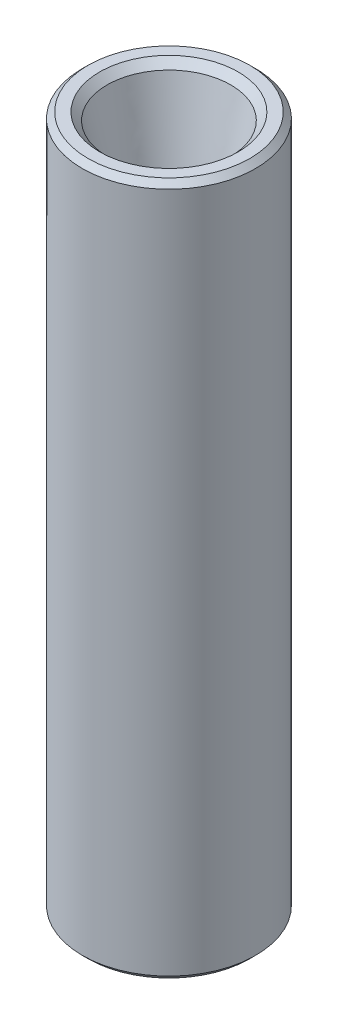
ISO-10303-21;
HEADER;
FILE_DESCRIPTION(('STEP AP214'),'2;1');
FILE_NAME('part.step','',(''),(''),'','','');
FILE_SCHEMA(('AUTOMOTIVE_DESIGN { 1 0 10303 214 1 1 1 1 }'));
ENDSEC;
DATA;
#1=APPLICATION_CONTEXT('core data for automotive mechanical design processes');
#2=APPLICATION_PROTOCOL_DEFINITION('international standard','automotive_design',2000,#1);
#3=PRODUCT_CONTEXT('',#1,'mechanical');
#4=PRODUCT('Part','Part','',(#3));
#5=PRODUCT_RELATED_PRODUCT_CATEGORY('part','',(#4));
#6=PRODUCT_DEFINITION_FORMATION('','',#4);
#7=PRODUCT_DEFINITION_CONTEXT('part definition',#1,'design');
#8=PRODUCT_DEFINITION('design','',#6,#7);
#9=PRODUCT_DEFINITION_SHAPE('','',#8);
#10=(LENGTH_UNIT() NAMED_UNIT(*) SI_UNIT(.MILLI.,.METRE.));
#11=(NAMED_UNIT(*) PLANE_ANGLE_UNIT() SI_UNIT($,.RADIAN.));
#12=(NAMED_UNIT(*) SI_UNIT($,.STERADIAN.) SOLID_ANGLE_UNIT());
#13=UNCERTAINTY_MEASURE_WITH_UNIT(LENGTH_MEASURE(1.E-05),#10,'distance_accuracy_value','');
#14=(GEOMETRIC_REPRESENTATION_CONTEXT(3) GLOBAL_UNCERTAINTY_ASSIGNED_CONTEXT((#13)) GLOBAL_UNIT_ASSIGNED_CONTEXT((#10,
#11,#12)) REPRESENTATION_CONTEXT('',''));
#15=CARTESIAN_POINT('',(0.,0.,0.));
#16=DIRECTION('',(0.,0.,1.));
#17=DIRECTION('',(1.,0.,0.));
#18=AXIS2_PLACEMENT_3D('',#15,#16,#17);
#19=CARTESIAN_POINT('',(0.,60.,0.));
#20=DIRECTION('',(0.,-1.,0.));
#21=DIRECTION('',(0.,0.,-1.));
#22=AXIS2_PLACEMENT_3D('',#19,#20,#21);
#23=CYLINDRICAL_SURFACE('',#22,7.5);
#24=CARTESIAN_POINT('',(0.,0.5,0.));
#25=DIRECTION('',(0.,1.,0.));
#26=DIRECTION('',(0.,0.,1.));
#27=AXIS2_PLACEMENT_3D('',#24,#25,#26);
#28=CIRCLE('',#27,7.5);
#29=CARTESIAN_POINT('',(0.,0.5,7.5));
#30=VERTEX_POINT('',#29);
#31=EDGE_CURVE('E50',#30,#30,#28,.T.);
#32=ORIENTED_EDGE('',*,*,#31,.T.);
#33=EDGE_LOOP('',(#32));
#34=FACE_BOUND('',#33,.T.);
#35=CARTESIAN_POINT('',(0.,59.5,0.));
#36=DIRECTION('',(0.,1.,0.));
#37=DIRECTION('',(0.,0.,1.));
#38=AXIS2_PLACEMENT_3D('',#35,#36,#37);
#39=CIRCLE('',#38,7.5);
#40=CARTESIAN_POINT('',(0.,59.5,7.5));
#41=VERTEX_POINT('',#40);
#42=EDGE_CURVE('E55',#41,#41,#39,.F.);
#43=ORIENTED_EDGE('',*,*,#42,.T.);
#44=EDGE_LOOP('',(#43));
#45=FACE_BOUND('',#44,.T.);
#46=ADVANCED_FACE('F35',(#34,#45),#23,.T.);
#47=CARTESIAN_POINT('',(0.,60.,0.));
#48=DIRECTION('',(0.,1.,0.));
#49=DIRECTION('',(0.,0.,1.));
#50=AXIS2_PLACEMENT_3D('',#47,#48,#49);
#51=PLANE('',#50);
#52=CARTESIAN_POINT('',(0.,60.,0.));
#53=DIRECTION('',(0.,1.,0.));
#54=DIRECTION('',(0.,0.,1.));
#55=AXIS2_PLACEMENT_3D('',#52,#53,#54);
#56=CIRCLE('',#55,6.00000000000001);
#57=CARTESIAN_POINT('',(0.,60.,6.00000000000001));
#58=VERTEX_POINT('',#57);
#59=EDGE_CURVE('E58',#58,#58,#56,.F.);
#60=ORIENTED_EDGE('',*,*,#59,.T.);
#61=EDGE_LOOP('',(#60));
#62=FACE_BOUND('',#61,.T.);
#63=CARTESIAN_POINT('',(0.,60.,0.));
#64=DIRECTION('',(0.,1.,0.));
#65=DIRECTION('',(0.,0.,1.));
#66=AXIS2_PLACEMENT_3D('',#63,#64,#65);
#67=CIRCLE('',#66,6.99999999999999);
#68=CARTESIAN_POINT('',(0.,60.,6.99999999999999));
#69=VERTEX_POINT('',#68);
#70=EDGE_CURVE('E61',#69,#69,#67,.T.);
#71=ORIENTED_EDGE('',*,*,#70,.T.);
#72=EDGE_LOOP('',(#71));
#73=FACE_BOUND('',#72,.T.);
#74=ADVANCED_FACE('F103',(#62,#73),#51,.T.);
#75=CARTESIAN_POINT('',(0.,0.,0.));
#76=DIRECTION('',(0.,1.,0.));
#77=DIRECTION('',(0.,0.,1.));
#78=AXIS2_PLACEMENT_3D('',#75,#76,#77);
#79=PLANE('',#78);
#80=CARTESIAN_POINT('',(0.,0.,0.));
#81=DIRECTION('',(0.,1.,0.));
#82=DIRECTION('',(0.,0.,1.));
#83=AXIS2_PLACEMENT_3D('',#80,#81,#82);
#84=CIRCLE('',#83,7.);
#85=CARTESIAN_POINT('',(0.,0.,7.));
#86=VERTEX_POINT('',#85);
#87=EDGE_CURVE('E42',#86,#86,#84,.F.);
#88=ORIENTED_EDGE('',*,*,#87,.T.);
#89=EDGE_LOOP('',(#88));
#90=FACE_BOUND('',#89,.T.);
#91=CARTESIAN_POINT('',(0.,0.,0.));
#92=DIRECTION('',(0.,1.,0.));
#93=DIRECTION('',(0.,0.,1.));
#94=AXIS2_PLACEMENT_3D('',#91,#92,#93);
#95=CIRCLE('',#94,6.16527968894344);
#96=CARTESIAN_POINT('',(0.,0.,6.16527968894345));
#97=VERTEX_POINT('',#96);
#98=EDGE_CURVE('E46',#97,#97,#95,.T.);
#99=ORIENTED_EDGE('',*,*,#98,.T.);
#100=EDGE_LOOP('',(#99));
#101=FACE_BOUND('',#100,.T.);
#102=ADVANCED_FACE('F89',(#90,#101),#79,.F.);
#103=CARTESIAN_POINT('',(0.,40.,0.));
#104=DIRECTION('',(0.,1.,0.));
#105=DIRECTION('',(0.,0.,1.));
#106=AXIS2_PLACEMENT_3D('',#103,#104,#105);
#107=PLANE('',#106);
#108=CARTESIAN_POINT('',(0.,40.,0.));
#109=DIRECTION('',(0.,1.,0.));
#110=DIRECTION('',(0.,0.,1.));
#111=AXIS2_PLACEMENT_3D('',#108,#109,#110);
#112=CIRCLE('',#111,2.5);
#113=CARTESIAN_POINT('',(1.34354340692469,40.,-2.10829104103518));
#114=VERTEX_POINT('',#113);
#115=EDGE_CURVE('E67',#114,#114,#112,.T.);
#116=ORIENTED_EDGE('',*,*,#115,.T.);
#117=EDGE_LOOP('',(#116));
#118=FACE_BOUND('',#117,.T.);
#119=ADVANCED_FACE('F78',(#118),#107,.T.);
#120=CARTESIAN_POINT('',(1.34354340692469,40.,-2.10829104103518));
#121=CARTESIAN_POINT('',(5.40062765230994,60.,1.04077901646087));
#122=CARTESIAN_POINT('',(-2.87303867514567,40.,-4.79537785488456));
#123=CARTESIAN_POINT('',(7.48218568523168,60.,-9.760476288159));
#124=CARTESIAN_POINT('',(-5.56012548899505,40.,-0.578795772814199));
#125=CARTESIAN_POINT('',(-3.31906961938819,60.,-11.8420343210807));
#126=CARTESIAN_POINT('',(-1.34354340692469,40.,2.10829104103518));
#127=CARTESIAN_POINT('',(-5.40062765230994,60.,-1.04077901646087));
#128=CARTESIAN_POINT('',(2.87303867514567,40.,4.79537785488456));
#129=CARTESIAN_POINT('',(-7.48218568523168,60.,9.760476288159));
#130=CARTESIAN_POINT('',(5.56012548899505,40.,0.578795772814198));
#131=CARTESIAN_POINT('',(3.31906961938819,60.,11.8420343210807));
#132=CARTESIAN_POINT('',(1.34354340692469,40.,-2.10829104103518));
#133=CARTESIAN_POINT('',(5.40062765230994,60.,1.04077901646087));
#134=(BOUNDED_SURFACE() B_SPLINE_SURFACE(3,1,((#120,#121),(#122,#123),(#124,#125),(#126,#127),
(#128,#129),(#130,#131),(#132,#133)),.UNSPECIFIED.,.T.,.F.,.F.) B_SPLINE_SURFACE_WITH_KNOTS((4,
3,4),(2,2),(0.,0.5,1.),(0.,1.),
.UNSPECIFIED.) GEOMETRIC_REPRESENTATION_ITEM() RATIONAL_B_SPLINE_SURFACE(((1.,1.),
(0.333333333333333,0.333333333333333),(0.333333333333333,0.333333333333333),(1.,1.),
(0.333333333333333,0.333333333333333),(0.333333333333333,0.333333333333333),(1.,1.))) REPRESENTATION_ITEM('') SURFACE());
#135=CARTESIAN_POINT('',(0.,59.3521915229048,0.));
#136=DIRECTION('',(0.,1.,0.));
#137=DIRECTION('',(0.,0.,1.));
#138=AXIS2_PLACEMENT_3D('',#135,#136,#137);
#139=CIRCLE('',#138,5.35219152290481);
#140=CARTESIAN_POINT('',(5.26921697398744,59.3521915229048,0.938779302550239));
#141=VERTEX_POINT('',#140);
#142=EDGE_CURVE('E64',#141,#141,#139,.T.);
#143=CARTESIAN_POINT('',(5.26921697398744,59.3521915229048,0.938779302550239));
#144=CARTESIAN_POINT('',(5.2283245409972,59.1506061945412,0.907038986471225));
#145=CARTESIAN_POINT('',(5.18743210800697,58.9490208661776,0.87529867039221));
#146=CARTESIAN_POINT('',(5.10564724202649,58.5458502094504,0.81181803823418));
#147=CARTESIAN_POINT('',(5.06475480903625,58.3442648810868,0.780077722155165));
#148=CARTESIAN_POINT('',(4.98296994305578,57.9410942243597,0.716597089997136));
#149=CARTESIAN_POINT('',(4.94207751006554,57.7395088959961,0.684856773918121));
#150=CARTESIAN_POINT('',(4.86029264408507,57.3363382392689,0.621376141760092));
#151=CARTESIAN_POINT('',(4.81940021109483,57.1347529109053,0.589635825681077));
#152=CARTESIAN_POINT('',(4.73761534511436,56.7315822541781,0.526155193523047));
#153=CARTESIAN_POINT('',(4.69672291212412,56.5299969258145,0.494414877444032));
#154=CARTESIAN_POINT('',(4.61493804614365,56.1268262690873,0.430934245286003));
#155=CARTESIAN_POINT('',(4.57404561315341,55.9252409407237,0.399193929206988));
#156=CARTESIAN_POINT('',(4.49226074717294,55.5220702839966,0.335713297048958));
#157=CARTESIAN_POINT('',(4.4513683141827,55.320484955633,0.303972980969944));
#158=CARTESIAN_POINT('',(4.36958344820223,54.9173142989058,0.240492348811914));
#159=CARTESIAN_POINT('',(4.32869101521199,54.7157289705422,0.208752032732899));
#160=CARTESIAN_POINT('',(4.24690614923151,54.312558313815,0.14527140057487));
#161=CARTESIAN_POINT('',(4.20601371624128,54.1109729854514,0.113531084495855));
#162=CARTESIAN_POINT('',(4.1242288502608,53.7078023287242,0.0500504523378259));
#163=CARTESIAN_POINT('',(4.08333641727057,53.5062170003606,0.018310136258811));
#164=CARTESIAN_POINT('',(4.00155155129009,53.1030463436335,-0.0451704958992186));
#165=CARTESIAN_POINT('',(3.96065911829986,52.9014610152699,-0.0769108119782334));
#166=CARTESIAN_POINT('',(3.87887425231938,52.4982903585427,-0.140391444136263));
#167=CARTESIAN_POINT('',(3.83798181932914,52.2967050301791,-0.172131760215278));
#168=CARTESIAN_POINT('',(3.75619695334867,51.8935343734519,-0.235612392373307));
#169=CARTESIAN_POINT('',(3.71530452035843,51.6919490450883,-0.267352708452322));
#170=CARTESIAN_POINT('',(3.63351965437796,51.2887783883611,-0.330833340610351));
#171=CARTESIAN_POINT('',(3.59262722138772,51.0871930599975,-0.362573656689367));
#172=CARTESIAN_POINT('',(3.51084235540725,50.6840224032704,-0.426054288847396));
#173=CARTESIAN_POINT('',(3.46994992241701,50.4824370749068,-0.457794604926411));
#174=CARTESIAN_POINT('',(3.38816505643654,50.0792664181796,-0.52127523708444));
#175=CARTESIAN_POINT('',(3.3472726234463,49.877681089816,-0.553015553163455));
#176=CARTESIAN_POINT('',(3.26548775746583,49.4745104330888,-0.616496185321485));
#177=CARTESIAN_POINT('',(3.22459532447559,49.2729251047252,-0.648236501400499));
#178=CARTESIAN_POINT('',(3.14281045849512,48.869754447998,-0.711717133558529));
#179=CARTESIAN_POINT('',(3.10191802550488,48.6681691196344,-0.743457449637544));
#180=CARTESIAN_POINT('',(3.0201331595244,48.2649984629073,-0.806938081795573));
#181=CARTESIAN_POINT('',(2.97924072653417,48.0634131345437,-0.838678397874588));
#182=CARTESIAN_POINT('',(2.89745586055369,47.6602424778165,-0.902159030032617));
#183=CARTESIAN_POINT('',(2.85656342756346,47.4586571494529,-0.933899346111632));
#184=CARTESIAN_POINT('',(2.77477856158298,47.0554864927257,-0.997379978269662));
#185=CARTESIAN_POINT('',(2.73388612859275,46.8539011643621,-1.02912029434868));
#186=CARTESIAN_POINT('',(2.65210126261227,46.4507305076349,-1.09260092650671));
#187=CARTESIAN_POINT('',(2.61120882962204,46.2491451792713,-1.12434124258572));
#188=CARTESIAN_POINT('',(2.52942396364156,45.8459745225442,-1.18782187474375));
#189=CARTESIAN_POINT('',(2.48853153065132,45.6443891941806,-1.21956219082277));
#190=CARTESIAN_POINT('',(2.40674666467085,45.2412185374534,-1.28304282298079));
#191=CARTESIAN_POINT('',(2.36585423168061,45.0396332090898,-1.31478313905981));
#192=CARTESIAN_POINT('',(2.28406936570014,44.6364625523626,-1.37826377121784));
#193=CARTESIAN_POINT('',(2.2431769327099,44.434877223999,-1.41000408729685));
#194=CARTESIAN_POINT('',(2.16139206672943,44.0317065672718,-1.47348471945488));
#195=CARTESIAN_POINT('',(2.12049963373919,43.8301212389082,-1.5052250355339));
#196=CARTESIAN_POINT('',(2.03871476775872,43.4269505821811,-1.56870566769193));
#197=CARTESIAN_POINT('',(1.99782233476848,43.2253652538175,-1.60044598377094));
#198=CARTESIAN_POINT('',(1.91603746878801,42.8221945970903,-1.66392661592897));
#199=CARTESIAN_POINT('',(1.87514503579777,42.6206092687267,-1.69566693200799));
#200=CARTESIAN_POINT('',(1.7933601698173,42.2174386119995,-1.75914756416602));
#201=CARTESIAN_POINT('',(1.75246773682706,42.0158532836359,-1.79088788024503));
#202=CARTESIAN_POINT('',(1.67068287084658,41.6126826269087,-1.85436851240306));
#203=CARTESIAN_POINT('',(1.62979043785635,41.4110972985451,-1.88610882848208));
#204=CARTESIAN_POINT('',(1.54800557187587,41.007926641818,-1.94958946064011));
#205=CARTESIAN_POINT('',(1.50711313888564,40.8063413134544,-1.98132977671912));
#206=CARTESIAN_POINT('',(1.42532827290516,40.4031706567272,-2.04481040887715));
#207=CARTESIAN_POINT('',(1.38443583991493,40.2015853283636,-2.07655072495616));
#208=CARTESIAN_POINT('',(1.34354340692469,40.,-2.10829104103518));
#209=B_SPLINE_CURVE_WITH_KNOTS('',3,(#143,#144,#145,#146,#147,#148,#149,#150,#151,#152,#153,
#154,#155,#156,#157,#158,#159,#160,#161,#162,#163,#164,#165,#166,#167,#168,#169,#170,#171,#172,
#173,#174,#175,#176,#177,#178,#179,#180,#181,#182,#183,#184,#185,#186,#187,#188,#189,#190,#191,
#192,#193,#194,#195,#196,#197,#198,#199,#200,#201,#202,#203,#204,#205,#206,#207,#208),
.UNSPECIFIED.,.F.,.F.,(4,2,2,2,2,2,2,2,2,2,2,2,2,2,2,2,2,2,2,2,2,2,2,2,2,2,2,2,2,2,2,2,4),(0.,
0.624376929561813,1.24875385912361,1.87313078868542,2.49750771824722,3.12188464780902,
3.74626157737082,4.37063850693262,4.99501543649443,5.61939236605624,6.24376929561804,
6.86814622517983,7.49252315474164,8.11690008430345,8.74127701386525,9.36565394342705,
9.99003087298885,10.6144078025507,11.2387847321125,11.8631616616743,12.4875385912361,
13.1119155207979,13.7362924503597,14.3606693799215,14.9850463094833,15.6094232390451,
16.2338001686069,16.8581770981687,17.4825540277305,18.1069309572923,18.7313078868541,
19.3556848164159,19.9800617459777),.UNSPECIFIED.);
#210=EDGE_CURVE('BSEAM88',#141,#114,#209,.T.);
#211=ORIENTED_EDGE('',*,*,#142,.T.);
#212=ORIENTED_EDGE('',*,*,#115,.F.);
#213=ORIENTED_EDGE('',*,*,#210,.T.);
#214=ORIENTED_EDGE('',*,*,#210,.F.);
#215=EDGE_LOOP('',(#211,#213,#212,#214));
#216=FACE_BOUND('',#215,.T.);
#217=ADVANCED_FACE('F88',(#216),#134,.F.);
#218=CARTESIAN_POINT('',(0.,59.3521915229048,0.));
#219=DIRECTION('',(0.,1.,0.));
#220=DIRECTION('',(0.,0.,1.));
#221=AXIS2_PLACEMENT_3D('',#218,#219,#220);
#222=CONICAL_SURFACE('',#221,5.35219152290481,0.785398163397462);
#223=ORIENTED_EDGE('',*,*,#59,.F.);
#224=EDGE_LOOP('',(#223));
#225=FACE_BOUND('',#224,.T.);
#226=ORIENTED_EDGE('',*,*,#142,.F.);
#227=EDGE_LOOP('',(#226));
#228=FACE_BOUND('',#227,.T.);
#229=ADVANCED_FACE('F101',(#225,#228),#222,.F.);
#230=CARTESIAN_POINT('',(0.,60.,0.));
#231=DIRECTION('',(0.,-1.,0.));
#232=DIRECTION('',(0.,0.,-1.));
#233=AXIS2_PLACEMENT_3D('',#230,#231,#232);
#234=CONICAL_SURFACE('',#233,6.99999999999999,0.785398163397442);
#235=ORIENTED_EDGE('',*,*,#42,.F.);
#236=EDGE_LOOP('',(#235));
#237=FACE_BOUND('',#236,.T.);
#238=ORIENTED_EDGE('',*,*,#70,.F.);
#239=EDGE_LOOP('',(#238));
#240=FACE_BOUND('',#239,.T.);
#241=ADVANCED_FACE('F138',(#237,#240),#234,.T.);
#242=CARTESIAN_POINT('',(0.,20.,0.));
#243=DIRECTION('',(0.,-1.,0.));
#244=DIRECTION('',(0.,0.,1.));
#245=AXIS2_PLACEMENT_3D('',#242,#243,#244);
#246=PLANE('',#245);
#247=CARTESIAN_POINT('',(0.,20.,0.));
#248=DIRECTION('',(0.,1.,0.));
#249=DIRECTION('',(0.,0.,1.));
#250=AXIS2_PLACEMENT_3D('',#247,#248,#249);
#251=CIRCLE('',#250,2.5);
#252=CARTESIAN_POINT('',(1.34354340692469,20.,-2.10829104103518));
#253=VERTEX_POINT('',#252);
#254=EDGE_CURVE('E72',#253,#253,#251,.T.);
#255=ORIENTED_EDGE('',*,*,#254,.F.);
#256=EDGE_LOOP('',(#255));
#257=FACE_BOUND('',#256,.T.);
#258=ADVANCED_FACE('F130',(#257),#246,.T.);
#259=CARTESIAN_POINT('',(1.34354340692469,20.,-2.10829104103518));
#260=CARTESIAN_POINT('',(5.40062765230994,0.,1.04077901646087));
#261=CARTESIAN_POINT('',(-2.87303867514567,20.,-4.79537785488456));
#262=CARTESIAN_POINT('',(7.48218568523168,0.,-9.760476288159));
#263=CARTESIAN_POINT('',(-5.56012548899505,20.,-0.578795772814199));
#264=CARTESIAN_POINT('',(-3.31906961938819,0.,-11.8420343210807));
#265=CARTESIAN_POINT('',(-1.34354340692469,20.,2.10829104103518));
#266=CARTESIAN_POINT('',(-5.40062765230994,0.,-1.04077901646087));
#267=CARTESIAN_POINT('',(2.87303867514567,20.,4.79537785488456));
#268=CARTESIAN_POINT('',(-7.48218568523168,0.,9.760476288159));
#269=CARTESIAN_POINT('',(5.56012548899505,20.,0.578795772814198));
#270=CARTESIAN_POINT('',(3.31906961938819,0.,11.8420343210807));
#271=CARTESIAN_POINT('',(1.34354340692469,20.,-2.10829104103518));
#272=CARTESIAN_POINT('',(5.40062765230994,0.,1.04077901646087));
#273=(BOUNDED_SURFACE() B_SPLINE_SURFACE(3,1,((#259,#260),(#261,#262),(#263,#264),(#265,#266),
(#267,#268),(#269,#270),(#271,#272)),.UNSPECIFIED.,.T.,.F.,.F.) B_SPLINE_SURFACE_WITH_KNOTS((4,
3,4),(2,2),(0.,0.5,1.),(0.,1.),
.UNSPECIFIED.) GEOMETRIC_REPRESENTATION_ITEM() RATIONAL_B_SPLINE_SURFACE(((1.,1.),
(0.333333333333333,0.333333333333333),(0.333333333333333,0.333333333333333),(1.,1.),
(0.333333333333333,0.333333333333333),(0.333333333333333,0.333333333333333),(1.,1.))) REPRESENTATION_ITEM('') SURFACE());
#274=CARTESIAN_POINT('',(0.,0.487167570911187,0.));
#275=DIRECTION('',(0.,1.,0.));
#276=DIRECTION('',(-1.,0.,0.));
#277=AXIS2_PLACEMENT_3D('',#274,#275,#276);
#278=CIRCLE('',#277,5.38874367086231);
#279=CARTESIAN_POINT('',(5.30180365846962,0.487167570911189,0.964072775933895));
#280=VERTEX_POINT('',#279);
#281=EDGE_CURVE('E11',#280,#280,#278,.F.);
#282=CARTESIAN_POINT('',(5.30180365846962,0.487167570911189,0.964072775933895));
#283=CARTESIAN_POINT('',(5.26057178084936,0.690426242047531,0.9320689861738));
#284=CARTESIAN_POINT('',(5.2193399032291,0.893684913183872,0.900065196413706));
#285=CARTESIAN_POINT('',(5.13687614798858,1.30020225545656,0.836057616893517));
#286=CARTESIAN_POINT('',(5.09564427036832,1.5034609265929,0.804053827133422));
#287=CARTESIAN_POINT('',(5.0131805151278,1.90997826886558,0.740046247613233));
#288=CARTESIAN_POINT('',(4.97194863750754,2.11323694000192,0.708042457853138));
#289=CARTESIAN_POINT('',(4.88948488226702,2.51975428227461,0.64403487833295));
#290=CARTESIAN_POINT('',(4.84825300464676,2.72301295341095,0.612031088572855));
#291=CARTESIAN_POINT('',(4.76578924940624,3.12953029568363,0.548023509052666));
#292=CARTESIAN_POINT('',(4.72455737178598,3.33278896681997,0.516019719292572));
#293=CARTESIAN_POINT('',(4.64209361654546,3.73930630909266,0.452012139772382));
#294=CARTESIAN_POINT('',(4.6008617389252,3.942564980229,0.420008350012288));
#295=CARTESIAN_POINT('',(4.51839798368468,4.34908232250168,0.356000770492099));
#296=CARTESIAN_POINT('',(4.47716610606442,4.55234099363803,0.323996980732004));
#297=CARTESIAN_POINT('',(4.3947023508239,4.95885833591071,0.259989401211815));
#298=CARTESIAN_POINT('',(4.35347047320365,5.16211700704705,0.227985611451721));
#299=CARTESIAN_POINT('',(4.27100671796313,5.56863434931973,0.163978031931532));
#300=CARTESIAN_POINT('',(4.22977484034287,5.77189302045608,0.131974242171437));
#301=CARTESIAN_POINT('',(4.14731108510235,6.17841036272876,0.0679666626512481));
#302=CARTESIAN_POINT('',(4.10607920748209,6.3816690338651,0.0359628728911537));
#303=CARTESIAN_POINT('',(4.02361545224157,6.78818637613778,-0.0280447066290353));
#304=CARTESIAN_POINT('',(3.98238357462131,6.99144504727413,-0.0600484963891299));
#305=CARTESIAN_POINT('',(3.89991981938079,7.39796238954681,-0.124056075909319));
#306=CARTESIAN_POINT('',(3.85868794176053,7.60122106068315,-0.156059865669413));
#307=CARTESIAN_POINT('',(3.77622418652001,8.00773840295584,-0.220067445189603));
#308=CARTESIAN_POINT('',(3.73499230889975,8.21099707409218,-0.252071234949697));
#309=CARTESIAN_POINT('',(3.65252855365923,8.61751441636486,-0.316078814469886));
#310=CARTESIAN_POINT('',(3.61129667603897,8.8207730875012,-0.34808260422998));
#311=CARTESIAN_POINT('',(3.52883292079845,9.22729042977389,-0.41209018375017));
#312=CARTESIAN_POINT('',(3.48760104317819,9.43054910091023,-0.444093973510264));
#313=CARTESIAN_POINT('',(3.40513728793767,9.83706644318291,-0.508101553030453));
#314=CARTESIAN_POINT('',(3.36390541031741,10.0403251143193,-0.540105342790548));
#315=CARTESIAN_POINT('',(3.28144165507689,10.4468424565919,-0.604112922310737));
#316=CARTESIAN_POINT('',(3.24020977745663,10.6501011277283,-0.636116712070831));
#317=CARTESIAN_POINT('',(3.15774602221611,11.056618470001,-0.70012429159102));
#318=CARTESIAN_POINT('',(3.11651414459585,11.2598771411373,-0.732128081351115));
#319=CARTESIAN_POINT('',(3.03405038935534,11.66639448341,-0.796135660871304));
#320=CARTESIAN_POINT('',(2.99281851173508,11.8696531545463,-0.828139450631398));
#321=CARTESIAN_POINT('',(2.91035475649456,12.276170496819,-0.892147030151587));
#322=CARTESIAN_POINT('',(2.8691228788743,12.4794291679554,-0.924150819911682));
#323=CARTESIAN_POINT('',(2.78665912363378,12.885946510228,-0.988158399431871));
#324=CARTESIAN_POINT('',(2.74542724601352,13.0892051813644,-1.02016218919197));
#325=CARTESIAN_POINT('',(2.662963490773,13.4957225236371,-1.08416976871215));
#326=CARTESIAN_POINT('',(2.62173161315274,13.6989811947734,-1.11617355847225));
#327=CARTESIAN_POINT('',(2.53926785791222,14.1054985370461,-1.18018113799244));
#328=CARTESIAN_POINT('',(2.49803598029196,14.3087572081824,-1.21218492775253));
#329=CARTESIAN_POINT('',(2.41557222505144,14.7152745504551,-1.27619250727272));
#330=CARTESIAN_POINT('',(2.37434034743118,14.9185332215915,-1.30819629703282));
#331=CARTESIAN_POINT('',(2.29187659219066,15.3250505638641,-1.37220387655301));
#332=CARTESIAN_POINT('',(2.2506447145704,15.5283092350005,-1.4042076663131));
#333=CARTESIAN_POINT('',(2.16818095932988,15.9348265772732,-1.46821524583329));
#334=CARTESIAN_POINT('',(2.12694908170962,16.1380852484095,-1.50021903559338));
#335=CARTESIAN_POINT('',(2.0444853264691,16.5446025906822,-1.56422661511357));
#336=CARTESIAN_POINT('',(2.00325344884884,16.7478612618185,-1.59623040487367));
#337=CARTESIAN_POINT('',(1.92078969360832,17.1543786040912,-1.66023798439386));
#338=CARTESIAN_POINT('',(1.87955781598806,17.3576372752276,-1.69224177415395));
#339=CARTESIAN_POINT('',(1.79709406074755,17.7641546175002,-1.75624935367414));
#340=CARTESIAN_POINT('',(1.75586218312729,17.9674132886366,-1.78825314343423));
#341=CARTESIAN_POINT('',(1.67339842788677,18.3739306309093,-1.85226072295442));
#342=CARTESIAN_POINT('',(1.63216655026651,18.5771893020456,-1.88426451271452));
#343=CARTESIAN_POINT('',(1.54970279502599,18.9837066443183,-1.94827209223471));
#344=CARTESIAN_POINT('',(1.50847091740573,19.1869653154546,-1.9802758819948));
#345=CARTESIAN_POINT('',(1.42600716216521,19.5934826577273,-2.04428346151499));
#346=CARTESIAN_POINT('',(1.38477528454495,19.7967413288637,-2.07628725127508));
#347=CARTESIAN_POINT('',(1.34354340692469,20.,-2.10829104103518));
#348=B_SPLINE_CURVE_WITH_KNOTS('',3,(#282,#283,#284,#285,#286,#287,#288,#289,#290,#291,#292,
#293,#294,#295,#296,#297,#298,#299,#300,#301,#302,#303,#304,#305,#306,#307,#308,#309,#310,#311,
#312,#313,#314,#315,#316,#317,#318,#319,#320,#321,#322,#323,#324,#325,#326,#327,#328,#329,#330,
#331,#332,#333,#334,#335,#336,#337,#338,#339,#340,#341,#342,#343,#344,#345,#346,#347),
.UNSPECIFIED.,.F.,.F.,(4,2,2,2,2,2,2,2,2,2,2,2,2,2,2,2,2,2,2,2,2,2,2,2,2,2,2,2,2,2,2,2,4),(0.,
0.629559829681744,1.25911965936349,1.88867948904523,2.51823931872698,3.14779914840872,
3.77735897809047,4.40691880777221,5.03647863745396,5.6660384671357,6.29559829681745,
6.92515812649919,7.55471795618094,8.18427778586268,8.81383761554443,9.44339744522618,
10.0729572749079,10.7025171045897,11.3320769342714,11.9616367639532,12.5911965936349,
13.2207564233166,13.8503162529984,14.4798760826801,15.1094359123619,15.7389957420436,
16.3685555717254,16.9981154014071,17.6276752310889,18.2572350607706,18.8867948904523,
19.5163547201341,20.1459145498158),.UNSPECIFIED.);
#349=EDGE_CURVE('BSEAM91',#280,#253,#348,.T.);
#350=ORIENTED_EDGE('',*,*,#281,.T.);
#351=ORIENTED_EDGE('',*,*,#254,.T.);
#352=ORIENTED_EDGE('',*,*,#349,.T.);
#353=ORIENTED_EDGE('',*,*,#349,.F.);
#354=EDGE_LOOP('',(#350,#352,#351,#353));
#355=FACE_BOUND('',#354,.T.);
#356=ADVANCED_FACE('F91',(#355),#273,.T.);
#357=CARTESIAN_POINT('',(0.,0.5,0.));
#358=DIRECTION('',(0.,1.,0.));
#359=DIRECTION('',(0.,0.,1.));
#360=AXIS2_PLACEMENT_3D('',#357,#358,#359);
#361=CONICAL_SURFACE('',#360,7.5,0.785398163397447);
#362=ORIENTED_EDGE('',*,*,#87,.F.);
#363=EDGE_LOOP('',(#362));
#364=FACE_BOUND('',#363,.T.);
#365=ORIENTED_EDGE('',*,*,#31,.F.);
#366=EDGE_LOOP('',(#365));
#367=FACE_BOUND('',#366,.T.);
#368=ADVANCED_FACE('F144',(#364,#367),#361,.T.);
#369=CARTESIAN_POINT('',(0.,0.,0.));
#370=DIRECTION('',(0.,-1.,0.));
#371=DIRECTION('',(1.,0.,0.));
#372=AXIS2_PLACEMENT_3D('',#369,#370,#371);
#373=CONICAL_SURFACE('',#372,6.16527968894343,1.01050179299108);
#374=ORIENTED_EDGE('',*,*,#281,.F.);
#375=EDGE_LOOP('',(#374));
#376=FACE_BOUND('',#375,.T.);
#377=ORIENTED_EDGE('',*,*,#98,.F.);
#378=EDGE_LOOP('',(#377));
#379=FACE_BOUND('',#378,.T.);
#380=ADVANCED_FACE('F37',(#376,#379),#373,.F.);
#381=CLOSED_SHELL('',(#46,#74,#102,#119,#217,#229,#241,#258,#356,#368,#380));
#382=MANIFOLD_SOLID_BREP('B2',#381);
#383=ADVANCED_BREP_SHAPE_REPRESENTATION('',(#18,#382),#14);
#384=SHAPE_DEFINITION_REPRESENTATION(#9,#383);
ENDSEC;
END-ISO-10303-21;
